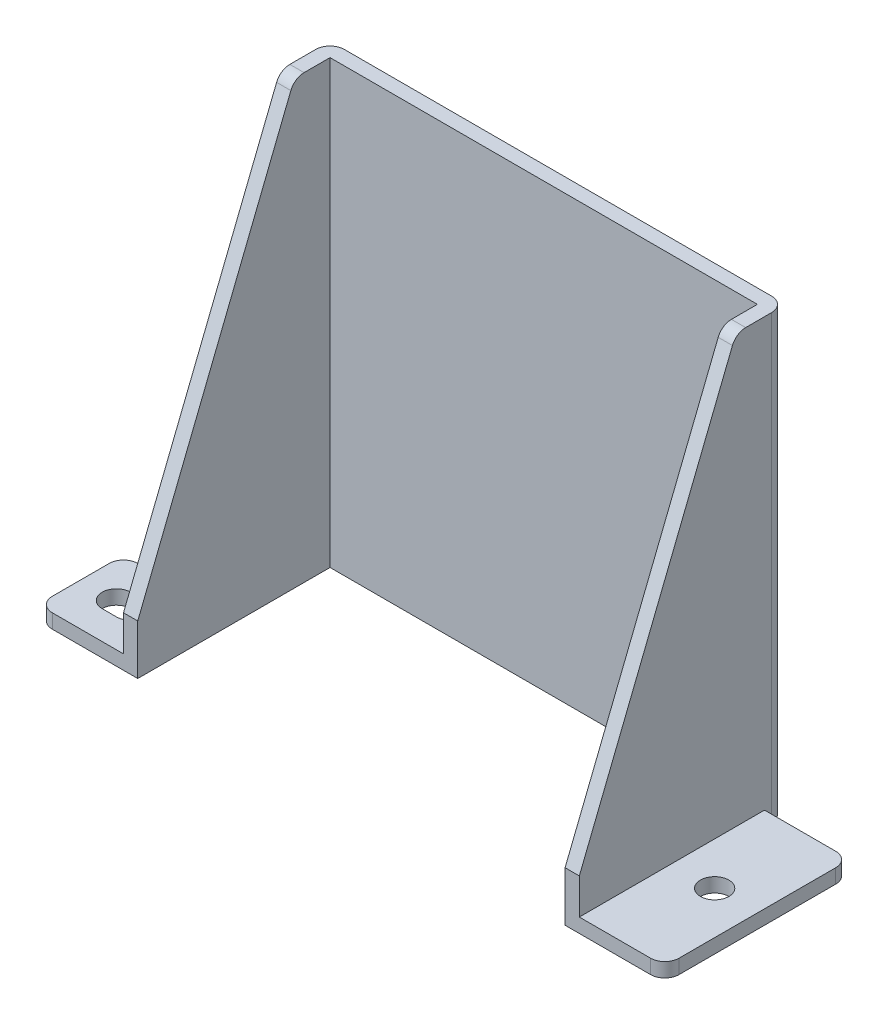
ISO-10303-21;
HEADER;
FILE_DESCRIPTION(('STEP AP214'),'2;1');
FILE_NAME('part.step','',(''),(''),'','','');
FILE_SCHEMA(('AUTOMOTIVE_DESIGN { 1 0 10303 214 1 1 1 1 }'));
ENDSEC;
DATA;
#1=APPLICATION_CONTEXT('core data for automotive mechanical design processes');
#2=APPLICATION_PROTOCOL_DEFINITION('international standard','automotive_design',2000,#1);
#3=PRODUCT_CONTEXT('',#1,'mechanical');
#4=PRODUCT('Part','Part','',(#3));
#5=PRODUCT_RELATED_PRODUCT_CATEGORY('part','',(#4));
#6=PRODUCT_DEFINITION_FORMATION('','',#4);
#7=PRODUCT_DEFINITION_CONTEXT('part definition',#1,'design');
#8=PRODUCT_DEFINITION('design','',#6,#7);
#9=PRODUCT_DEFINITION_SHAPE('','',#8);
#10=(LENGTH_UNIT() NAMED_UNIT(*) SI_UNIT(.MILLI.,.METRE.));
#11=(NAMED_UNIT(*) PLANE_ANGLE_UNIT() SI_UNIT($,.RADIAN.));
#12=(NAMED_UNIT(*) SI_UNIT($,.STERADIAN.) SOLID_ANGLE_UNIT());
#13=UNCERTAINTY_MEASURE_WITH_UNIT(LENGTH_MEASURE(1.E-05),#10,'distance_accuracy_value','');
#14=(GEOMETRIC_REPRESENTATION_CONTEXT(3) GLOBAL_UNCERTAINTY_ASSIGNED_CONTEXT((#13)) GLOBAL_UNIT_ASSIGNED_CONTEXT((#10,
#11,#12)) REPRESENTATION_CONTEXT('',''));
#15=CARTESIAN_POINT('',(0.,0.,0.));
#16=DIRECTION('',(0.,0.,1.));
#17=DIRECTION('',(1.,0.,0.));
#18=AXIS2_PLACEMENT_3D('',#15,#16,#17);
#19=CARTESIAN_POINT('',(0.,2.,0.));
#20=DIRECTION('',(0.,1.,0.));
#21=DIRECTION('',(0.,0.,1.));
#22=AXIS2_PLACEMENT_3D('',#19,#20,#21);
#23=PLANE('',#22);
#24=CARTESIAN_POINT('',(-39.,2.,8.5));
#25=DIRECTION('',(0.,1.,0.));
#26=DIRECTION('',(0.,0.,1.));
#27=AXIS2_PLACEMENT_3D('',#24,#25,#26);
#28=CIRCLE('',#27,2.);
#29=CARTESIAN_POINT('',(-39.,2.,6.5));
#30=VERTEX_POINT('',#29);
#31=CARTESIAN_POINT('',(-39.,2.,10.5));
#32=VERTEX_POINT('',#31);
#33=EDGE_CURVE('E229',#30,#32,#28,.T.);
#34=ORIENTED_EDGE('',*,*,#33,.F.);
#35=DIRECTION('',(-1.,0.,0.));
#36=VECTOR('',#35,1.);
#37=CARTESIAN_POINT('',(-39.,2.,6.5));
#38=LINE('',#37,#36);
#39=CARTESIAN_POINT('',(-37.,2.,6.5));
#40=VERTEX_POINT('',#39);
#41=EDGE_CURVE('E247',#40,#30,#38,.T.);
#42=ORIENTED_EDGE('',*,*,#41,.F.);
#43=CARTESIAN_POINT('',(-37.,2.,8.5));
#44=DIRECTION('',(0.,1.,0.));
#45=DIRECTION('',(0.,0.,1.));
#46=AXIS2_PLACEMENT_3D('',#43,#44,#45);
#47=CIRCLE('',#46,2.);
#48=CARTESIAN_POINT('',(-37.,2.,10.5));
#49=VERTEX_POINT('',#48);
#50=EDGE_CURVE('E250',#49,#40,#47,.T.);
#51=ORIENTED_EDGE('',*,*,#50,.F.);
#52=DIRECTION('',(1.,0.,0.));
#53=VECTOR('',#52,1.);
#54=CARTESIAN_POINT('',(-39.,2.,10.5));
#55=LINE('',#54,#53);
#56=EDGE_CURVE('E256',#32,#49,#55,.T.);
#57=ORIENTED_EDGE('',*,*,#56,.F.);
#58=EDGE_LOOP('',(#34,#42,#51,#57));
#59=FACE_BOUND('',#58,.T.);
#60=DIRECTION('',(1.,0.,0.));
#61=VECTOR('',#60,1.);
#62=CARTESIAN_POINT('',(0.,2.,2.5));
#63=LINE('',#62,#61);
#64=CARTESIAN_POINT('',(-42.,2.,2.5));
#65=VERTEX_POINT('',#64);
#66=CARTESIAN_POINT('',(-32.,2.,2.5));
#67=VERTEX_POINT('',#66);
#68=EDGE_CURVE('E317',#65,#67,#63,.T.);
#69=ORIENTED_EDGE('',*,*,#68,.F.);
#70=CARTESIAN_POINT('',(-42.,2.,4.5));
#71=DIRECTION('',(0.,1.,0.));
#72=DIRECTION('',(0.,0.,1.));
#73=AXIS2_PLACEMENT_3D('',#70,#71,#72);
#74=CIRCLE('',#73,2.);
#75=CARTESIAN_POINT('',(-44.,2.,4.5));
#76=VERTEX_POINT('',#75);
#77=EDGE_CURVE('E43',#65,#76,#74,.T.);
#78=ORIENTED_EDGE('',*,*,#77,.T.);
#79=DIRECTION('',(0.,0.,-1.));
#80=VECTOR('',#79,1.);
#81=CARTESIAN_POINT('',(-44.,2.,0.));
#82=LINE('',#81,#80);
#83=CARTESIAN_POINT('',(-44.,2.,12.5));
#84=VERTEX_POINT('',#83);
#85=EDGE_CURVE('E320',#84,#76,#82,.T.);
#86=ORIENTED_EDGE('',*,*,#85,.F.);
#87=CARTESIAN_POINT('',(-42.,2.,12.5));
#88=DIRECTION('',(0.,1.,0.));
#89=DIRECTION('',(0.,0.,1.));
#90=AXIS2_PLACEMENT_3D('',#87,#88,#89);
#91=CIRCLE('',#90,2.);
#92=CARTESIAN_POINT('',(-42.,2.,14.5));
#93=VERTEX_POINT('',#92);
#94=EDGE_CURVE('E50',#84,#93,#91,.T.);
#95=ORIENTED_EDGE('',*,*,#94,.T.);
#96=DIRECTION('',(1.,0.,0.));
#97=VECTOR('',#96,1.);
#98=CARTESIAN_POINT('',(0.,2.,14.5));
#99=LINE('',#98,#97);
#100=CARTESIAN_POINT('',(-32.,2.,14.5));
#101=VERTEX_POINT('',#100);
#102=EDGE_CURVE('E323',#93,#101,#99,.T.);
#103=ORIENTED_EDGE('',*,*,#102,.T.);
#104=DIRECTION('',(0.,0.,-1.));
#105=VECTOR('',#104,1.);
#106=CARTESIAN_POINT('',(-32.,2.,0.));
#107=LINE('',#106,#105);
#108=EDGE_CURVE('E284',#101,#67,#107,.T.);
#109=ORIENTED_EDGE('',*,*,#108,.T.);
#110=EDGE_LOOP('',(#69,#78,#86,#95,#103,#109));
#111=FACE_BOUND('',#110,.T.);
#112=ADVANCED_FACE('F35',(#59,#111),#23,.T.);
#113=CARTESIAN_POINT('',(38.,2.,1.5));
#114=DIRECTION('',(0.,1.,0.));
#115=DIRECTION('',(0.,0.,1.));
#116=AXIS2_PLACEMENT_3D('',#113,#114,#115);
#117=CIRCLE('',#116,2.);
#118=CARTESIAN_POINT('',(38.,2.,3.5));
#119=VERTEX_POINT('',#118);
#120=EDGE_CURVE('E269',#119,#119,#117,.T.);
#121=ORIENTED_EDGE('',*,*,#120,.F.);
#122=EDGE_LOOP('',(#121));
#123=FACE_BOUND('',#122,.T.);
#124=DIRECTION('',(0.,0.,-1.));
#125=VECTOR('',#124,1.);
#126=CARTESIAN_POINT('',(44.,2.,0.));
#127=LINE('',#126,#125);
#128=CARTESIAN_POINT('',(44.,2.,12.5));
#129=VERTEX_POINT('',#128);
#130=CARTESIAN_POINT('',(44.,2.,-9.5));
#131=VERTEX_POINT('',#130);
#132=EDGE_CURVE('E328',#129,#131,#127,.T.);
#133=ORIENTED_EDGE('',*,*,#132,.T.);
#134=CARTESIAN_POINT('',(42.,2.,-9.5));
#135=DIRECTION('',(0.,1.,0.));
#136=DIRECTION('',(0.,0.,1.));
#137=AXIS2_PLACEMENT_3D('',#134,#135,#136);
#138=CIRCLE('',#137,2.);
#139=CARTESIAN_POINT('',(42.,2.,-11.5));
#140=VERTEX_POINT('',#139);
#141=EDGE_CURVE('E397',#131,#140,#138,.T.);
#142=ORIENTED_EDGE('',*,*,#141,.T.);
#143=DIRECTION('',(-1.,0.,0.));
#144=VECTOR('',#143,1.);
#145=CARTESIAN_POINT('',(0.,2.,-11.5));
#146=LINE('',#145,#144);
#147=CARTESIAN_POINT('',(32.,2.,-11.5));
#148=VERTEX_POINT('',#147);
#149=EDGE_CURVE('E315',#140,#148,#146,.T.);
#150=ORIENTED_EDGE('',*,*,#149,.T.);
#151=DIRECTION('',(0.,0.,1.));
#152=VECTOR('',#151,1.);
#153=CARTESIAN_POINT('',(32.,2.,0.));
#154=LINE('',#153,#152);
#155=CARTESIAN_POINT('',(32.,2.,14.5));
#156=VERTEX_POINT('',#155);
#157=EDGE_CURVE('E305',#148,#156,#154,.T.);
#158=ORIENTED_EDGE('',*,*,#157,.T.);
#159=DIRECTION('',(1.,0.,0.));
#160=VECTOR('',#159,1.);
#161=CARTESIAN_POINT('',(0.,2.,14.5));
#162=LINE('',#161,#160);
#163=CARTESIAN_POINT('',(42.,2.,14.5));
#164=VERTEX_POINT('',#163);
#165=EDGE_CURVE('E325',#156,#164,#162,.T.);
#166=ORIENTED_EDGE('',*,*,#165,.T.);
#167=CARTESIAN_POINT('',(42.,2.,12.5));
#168=DIRECTION('',(0.,1.,0.));
#169=DIRECTION('',(0.,0.,1.));
#170=AXIS2_PLACEMENT_3D('',#167,#168,#169);
#171=CIRCLE('',#170,2.);
#172=EDGE_CURVE('E395',#164,#129,#171,.T.);
#173=ORIENTED_EDGE('',*,*,#172,.T.);
#174=EDGE_LOOP('',(#133,#142,#150,#158,#166,#173));
#175=FACE_BOUND('',#174,.T.);
#176=ADVANCED_FACE('F527',(#123,#175),#23,.T.);
#177=CARTESIAN_POINT('',(0.,2.,-11.5));
#178=DIRECTION('',(0.,0.,1.));
#179=DIRECTION('',(1.,0.,0.));
#180=AXIS2_PLACEMENT_3D('',#177,#178,#179);
#181=PLANE('',#180);
#182=ORIENTED_EDGE('',*,*,#149,.F.);
#183=DIRECTION('',(0.,-1.,0.));
#184=VECTOR('',#183,1.);
#185=CARTESIAN_POINT('',(42.,2.,-11.5));
#186=LINE('',#185,#184);
#187=CARTESIAN_POINT('',(42.,0.,-11.5));
#188=VERTEX_POINT('',#187);
#189=EDGE_CURVE('E308',#140,#188,#186,.T.);
#190=ORIENTED_EDGE('',*,*,#189,.T.);
#191=DIRECTION('',(-1.,0.,0.));
#192=VECTOR('',#191,1.);
#193=CARTESIAN_POINT('',(0.,0.,-11.5));
#194=LINE('',#193,#192);
#195=CARTESIAN_POINT('',(32.,0.,-11.5));
#196=VERTEX_POINT('',#195);
#197=EDGE_CURVE('E314',#188,#196,#194,.T.);
#198=ORIENTED_EDGE('',*,*,#197,.T.);
#199=DIRECTION('',(0.,-1.,0.));
#200=VECTOR('',#199,1.);
#201=CARTESIAN_POINT('',(32.,2.,-11.5));
#202=LINE('',#201,#200);
#203=EDGE_CURVE('E309',#148,#196,#202,.T.);
#204=ORIENTED_EDGE('',*,*,#203,.F.);
#205=EDGE_LOOP('',(#182,#190,#198,#204));
#206=FACE_BOUND('',#205,.T.);
#207=ADVANCED_FACE('F515',(#206),#181,.F.);
#208=CARTESIAN_POINT('',(32.,2.,0.));
#209=DIRECTION('',(-1.,0.,0.));
#210=DIRECTION('',(0.,0.,1.));
#211=AXIS2_PLACEMENT_3D('',#208,#209,#210);
#212=PLANE('',#211);
#213=DIRECTION('',(0.,0.,1.));
#214=VECTOR('',#213,1.);
#215=CARTESIAN_POINT('',(32.,62.,0.));
#216=LINE('',#215,#214);
#217=CARTESIAN_POINT('',(32.,62.,-12.5));
#218=VERTEX_POINT('',#217);
#219=CARTESIAN_POINT('',(32.,62.,-8.8540659228538));
#220=VERTEX_POINT('',#219);
#221=EDGE_CURVE('E296',#218,#220,#216,.T.);
#222=ORIENTED_EDGE('',*,*,#221,.T.);
#223=CARTESIAN_POINT('',(32.,60.,-8.8540659228538));
#224=DIRECTION('',(-1.,0.,0.));
#225=DIRECTION('',(0.,0.,1.));
#226=AXIS2_PLACEMENT_3D('',#223,#224,#225);
#227=CIRCLE('',#226,2.);
#228=CARTESIAN_POINT('',(32.,60.7427813527082,-6.99711254108329));
#229=VERTEX_POINT('',#228);
#230=EDGE_CURVE('E416',#220,#229,#227,.F.);
#231=ORIENTED_EDGE('',*,*,#230,.T.);
#232=DIRECTION('',(0.,-0.928476690885259,0.371390676354104));
#233=VECTOR('',#232,1.);
#234=CARTESIAN_POINT('',(31.9999999999999,7.68965517241377,14.2241379310345));
#235=LINE('',#234,#233);
#236=CARTESIAN_POINT('',(32.,7.,14.5));
#237=VERTEX_POINT('',#236);
#238=EDGE_CURVE('E282',#229,#237,#235,.T.);
#239=ORIENTED_EDGE('',*,*,#238,.T.);
#240=DIRECTION('',(0.,-1.,0.));
#241=VECTOR('',#240,1.);
#242=CARTESIAN_POINT('',(32.,62.,14.5));
#243=LINE('',#242,#241);
#244=EDGE_CURVE('E302',#237,#156,#243,.T.);
#245=ORIENTED_EDGE('',*,*,#244,.T.);
#246=ORIENTED_EDGE('',*,*,#157,.F.);
#247=ORIENTED_EDGE('',*,*,#203,.T.);
#248=DIRECTION('',(0.,0.,-1.));
#249=VECTOR('',#248,1.);
#250=CARTESIAN_POINT('',(32.,0.,0.));
#251=LINE('',#250,#249);
#252=CARTESIAN_POINT('',(32.,0.,-12.5));
#253=VERTEX_POINT('',#252);
#254=EDGE_CURVE('E333',#196,#253,#251,.T.);
#255=ORIENTED_EDGE('',*,*,#254,.T.);
#256=DIRECTION('',(0.,-1.,0.));
#257=VECTOR('',#256,1.);
#258=CARTESIAN_POINT('',(32.,62.,-12.5));
#259=LINE('',#258,#257);
#260=EDGE_CURVE('E414',#253,#218,#259,.F.);
#261=ORIENTED_EDGE('',*,*,#260,.T.);
#262=EDGE_LOOP('',(#222,#231,#239,#245,#246,#247,#255,#261));
#263=FACE_BOUND('',#262,.T.);
#264=ADVANCED_FACE('F504',(#263),#212,.F.);
#265=CARTESIAN_POINT('',(0.,2.,-14.5));
#266=DIRECTION('',(0.,0.,-1.));
#267=DIRECTION('',(-1.,0.,0.));
#268=AXIS2_PLACEMENT_3D('',#265,#266,#267);
#269=PLANE('',#268);
#270=DIRECTION('',(1.,0.,0.));
#271=VECTOR('',#270,1.);
#272=CARTESIAN_POINT('',(0.,0.,-14.5));
#273=LINE('',#272,#271);
#274=CARTESIAN_POINT('',(-30.,0.,-14.5));
#275=VERTEX_POINT('',#274);
#276=CARTESIAN_POINT('',(30.,0.,-14.5));
#277=VERTEX_POINT('',#276);
#278=EDGE_CURVE('E336',#275,#277,#273,.T.);
#279=ORIENTED_EDGE('',*,*,#278,.F.);
#280=DIRECTION('',(0.,-1.,0.));
#281=VECTOR('',#280,1.);
#282=CARTESIAN_POINT('',(-30.,2.,-14.5));
#283=LINE('',#282,#281);
#284=CARTESIAN_POINT('',(-30.,62.,-14.5));
#285=VERTEX_POINT('',#284);
#286=EDGE_CURVE('E431',#275,#285,#283,.F.);
#287=ORIENTED_EDGE('',*,*,#286,.T.);
#288=DIRECTION('',(-1.,0.,0.));
#289=VECTOR('',#288,1.);
#290=CARTESIAN_POINT('',(0.,62.,-14.5));
#291=LINE('',#290,#289);
#292=CARTESIAN_POINT('',(30.,62.,-14.5));
#293=VERTEX_POINT('',#292);
#294=EDGE_CURVE('E299',#293,#285,#291,.T.);
#295=ORIENTED_EDGE('',*,*,#294,.F.);
#296=DIRECTION('',(0.,-1.,0.));
#297=VECTOR('',#296,1.);
#298=CARTESIAN_POINT('',(30.,0.,-14.5));
#299=LINE('',#298,#297);
#300=EDGE_CURVE('E428',#293,#277,#299,.T.);
#301=ORIENTED_EDGE('',*,*,#300,.T.);
#302=EDGE_LOOP('',(#279,#287,#295,#301));
#303=FACE_BOUND('',#302,.T.);
#304=ADVANCED_FACE('F461',(#303),#269,.T.);
#305=CARTESIAN_POINT('',(-32.,2.,0.));
#306=DIRECTION('',(-1.,0.,0.));
#307=DIRECTION('',(0.,0.,1.));
#308=AXIS2_PLACEMENT_3D('',#305,#306,#307);
#309=PLANE('',#308);
#310=DIRECTION('',(0.,-0.928476690885259,0.371390676354104));
#311=VECTOR('',#310,1.);
#312=CARTESIAN_POINT('',(-32.,7.68965517241379,14.2241379310345));
#313=LINE('',#312,#311);
#314=CARTESIAN_POINT('',(-32.,60.7427813527082,-6.99711254108329));
#315=VERTEX_POINT('',#314);
#316=CARTESIAN_POINT('',(-32.,7.,14.5));
#317=VERTEX_POINT('',#316);
#318=EDGE_CURVE('E280',#315,#317,#313,.T.);
#319=ORIENTED_EDGE('',*,*,#318,.F.);
#320=CARTESIAN_POINT('',(-32.,60.,-8.8540659228538));
#321=DIRECTION('',(-1.,0.,0.));
#322=DIRECTION('',(0.,0.,1.));
#323=AXIS2_PLACEMENT_3D('',#320,#321,#322);
#324=CIRCLE('',#323,2.);
#325=CARTESIAN_POINT('',(-32.,62.,-8.8540659228538));
#326=VERTEX_POINT('',#325);
#327=EDGE_CURVE('E424',#315,#326,#324,.T.);
#328=ORIENTED_EDGE('',*,*,#327,.T.);
#329=DIRECTION('',(0.,0.,-1.));
#330=VECTOR('',#329,1.);
#331=CARTESIAN_POINT('',(-32.,62.,0.));
#332=LINE('',#331,#330);
#333=CARTESIAN_POINT('',(-32.,62.,-12.5));
#334=VERTEX_POINT('',#333);
#335=EDGE_CURVE('E285',#326,#334,#332,.T.);
#336=ORIENTED_EDGE('',*,*,#335,.T.);
#337=DIRECTION('',(0.,-1.,0.));
#338=VECTOR('',#337,1.);
#339=CARTESIAN_POINT('',(-32.,2.,-12.5));
#340=LINE('',#339,#338);
#341=CARTESIAN_POINT('',(-32.,0.,-12.5));
#342=VERTEX_POINT('',#341);
#343=EDGE_CURVE('E421',#334,#342,#340,.T.);
#344=ORIENTED_EDGE('',*,*,#343,.T.);
#345=DIRECTION('',(0.,0.,-1.));
#346=VECTOR('',#345,1.);
#347=CARTESIAN_POINT('',(-32.,0.,0.));
#348=LINE('',#347,#346);
#349=CARTESIAN_POINT('',(-32.,0.,2.5));
#350=VERTEX_POINT('',#349);
#351=EDGE_CURVE('E339',#350,#342,#348,.T.);
#352=ORIENTED_EDGE('',*,*,#351,.F.);
#353=DIRECTION('',(0.,-1.,0.));
#354=VECTOR('',#353,1.);
#355=CARTESIAN_POINT('',(-32.,2.,2.5));
#356=LINE('',#355,#354);
#357=EDGE_CURVE('E371',#67,#350,#356,.T.);
#358=ORIENTED_EDGE('',*,*,#357,.F.);
#359=ORIENTED_EDGE('',*,*,#108,.F.);
#360=DIRECTION('',(0.,-1.,0.));
#361=VECTOR('',#360,1.);
#362=CARTESIAN_POINT('',(-32.,62.,14.5));
#363=LINE('',#362,#361);
#364=EDGE_CURVE('E311',#317,#101,#363,.T.);
#365=ORIENTED_EDGE('',*,*,#364,.F.);
#366=EDGE_LOOP('',(#319,#328,#336,#344,#352,#358,#359,#365));
#367=FACE_BOUND('',#366,.T.);
#368=ADVANCED_FACE('F455',(#367),#309,.T.);
#369=CARTESIAN_POINT('',(0.,2.,2.5));
#370=DIRECTION('',(0.,0.,-1.));
#371=DIRECTION('',(-1.,0.,0.));
#372=AXIS2_PLACEMENT_3D('',#369,#370,#371);
#373=PLANE('',#372);
#374=DIRECTION('',(1.,0.,0.));
#375=VECTOR('',#374,1.);
#376=CARTESIAN_POINT('',(0.,0.,2.5));
#377=LINE('',#376,#375);
#378=CARTESIAN_POINT('',(-42.,0.,2.5));
#379=VERTEX_POINT('',#378);
#380=EDGE_CURVE('E342',#379,#350,#377,.T.);
#381=ORIENTED_EDGE('',*,*,#380,.F.);
#382=DIRECTION('',(0.,-1.,0.));
#383=VECTOR('',#382,1.);
#384=CARTESIAN_POINT('',(-42.,2.,2.5));
#385=LINE('',#384,#383);
#386=EDGE_CURVE('E58',#379,#65,#385,.F.);
#387=ORIENTED_EDGE('',*,*,#386,.T.);
#388=ORIENTED_EDGE('',*,*,#68,.T.);
#389=ORIENTED_EDGE('',*,*,#357,.T.);
#390=EDGE_LOOP('',(#381,#387,#388,#389));
#391=FACE_BOUND('',#390,.T.);
#392=ADVANCED_FACE('F449',(#391),#373,.T.);
#393=CARTESIAN_POINT('',(-44.,2.,0.));
#394=DIRECTION('',(-1.,0.,0.));
#395=DIRECTION('',(0.,0.,1.));
#396=AXIS2_PLACEMENT_3D('',#393,#394,#395);
#397=PLANE('',#396);
#398=ORIENTED_EDGE('',*,*,#85,.T.);
#399=DIRECTION('',(0.,-1.,0.));
#400=VECTOR('',#399,1.);
#401=CARTESIAN_POINT('',(-44.,2.,4.5));
#402=LINE('',#401,#400);
#403=CARTESIAN_POINT('',(-44.,0.,4.5));
#404=VERTEX_POINT('',#403);
#405=EDGE_CURVE('E435',#76,#404,#402,.T.);
#406=ORIENTED_EDGE('',*,*,#405,.T.);
#407=DIRECTION('',(0.,0.,-1.));
#408=VECTOR('',#407,1.);
#409=CARTESIAN_POINT('',(-44.,0.,0.));
#410=LINE('',#409,#408);
#411=CARTESIAN_POINT('',(-44.,0.,12.5));
#412=VERTEX_POINT('',#411);
#413=EDGE_CURVE('E344',#412,#404,#410,.T.);
#414=ORIENTED_EDGE('',*,*,#413,.F.);
#415=DIRECTION('',(0.,-1.,0.));
#416=VECTOR('',#415,1.);
#417=CARTESIAN_POINT('',(-44.,2.,12.5));
#418=LINE('',#417,#416);
#419=EDGE_CURVE('E433',#412,#84,#418,.F.);
#420=ORIENTED_EDGE('',*,*,#419,.T.);
#421=EDGE_LOOP('',(#398,#406,#414,#420));
#422=FACE_BOUND('',#421,.T.);
#423=ADVANCED_FACE('F443',(#422),#397,.T.);
#424=CARTESIAN_POINT('',(0.,2.,14.5));
#425=DIRECTION('',(0.,0.,-1.));
#426=DIRECTION('',(-1.,0.,0.));
#427=AXIS2_PLACEMENT_3D('',#424,#425,#426);
#428=PLANE('',#427);
#429=ORIENTED_EDGE('',*,*,#102,.F.);
#430=DIRECTION('',(0.,-1.,0.));
#431=VECTOR('',#430,1.);
#432=CARTESIAN_POINT('',(-42.,0.,14.5));
#433=LINE('',#432,#431);
#434=CARTESIAN_POINT('',(-42.,0.,14.5));
#435=VERTEX_POINT('',#434);
#436=EDGE_CURVE('E11',#93,#435,#433,.T.);
#437=ORIENTED_EDGE('',*,*,#436,.T.);
#438=DIRECTION('',(1.,0.,0.));
#439=VECTOR('',#438,1.);
#440=CARTESIAN_POINT('',(0.,0.,14.5));
#441=LINE('',#440,#439);
#442=CARTESIAN_POINT('',(-30.,0.,14.5));
#443=VERTEX_POINT('',#442);
#444=EDGE_CURVE('E347',#435,#443,#441,.T.);
#445=ORIENTED_EDGE('',*,*,#444,.T.);
#446=DIRECTION('',(0.,-1.,0.));
#447=VECTOR('',#446,1.);
#448=CARTESIAN_POINT('',(-30.,2.,14.5));
#449=LINE('',#448,#447);
#450=CARTESIAN_POINT('',(-30.,7.,14.5));
#451=VERTEX_POINT('',#450);
#452=EDGE_CURVE('E368',#451,#443,#449,.T.);
#453=ORIENTED_EDGE('',*,*,#452,.F.);
#454=DIRECTION('',(1.,0.,0.));
#455=VECTOR('',#454,1.);
#456=CARTESIAN_POINT('',(-44.,7.,14.5));
#457=LINE('',#456,#455);
#458=EDGE_CURVE('E274',#317,#451,#457,.T.);
#459=ORIENTED_EDGE('',*,*,#458,.F.);
#460=ORIENTED_EDGE('',*,*,#364,.T.);
#461=EDGE_LOOP('',(#429,#437,#445,#453,#459,#460));
#462=FACE_BOUND('',#461,.T.);
#463=ADVANCED_FACE('F546',(#462),#428,.F.);
#464=CARTESIAN_POINT('',(-30.,2.,0.));
#465=DIRECTION('',(-1.,0.,0.));
#466=DIRECTION('',(0.,0.,1.));
#467=AXIS2_PLACEMENT_3D('',#464,#465,#466);
#468=PLANE('',#467);
#469=DIRECTION('',(0.,0.,-1.));
#470=VECTOR('',#469,1.);
#471=CARTESIAN_POINT('',(-30.,62.,0.));
#472=LINE('',#471,#470);
#473=CARTESIAN_POINT('',(-30.,62.,-8.8540659228538));
#474=VERTEX_POINT('',#473);
#475=CARTESIAN_POINT('',(-30.,62.,-12.5));
#476=VERTEX_POINT('',#475);
#477=EDGE_CURVE('E288',#474,#476,#472,.T.);
#478=ORIENTED_EDGE('',*,*,#477,.F.);
#479=CARTESIAN_POINT('',(-30.,60.,-8.8540659228538));
#480=DIRECTION('',(-1.,0.,0.));
#481=DIRECTION('',(0.,0.,1.));
#482=AXIS2_PLACEMENT_3D('',#479,#480,#481);
#483=CIRCLE('',#482,2.);
#484=CARTESIAN_POINT('',(-30.,60.7427813527082,-6.99711254108329));
#485=VERTEX_POINT('',#484);
#486=EDGE_CURVE('E426',#474,#485,#483,.F.);
#487=ORIENTED_EDGE('',*,*,#486,.T.);
#488=DIRECTION('',(0.,-0.928476690885259,0.371390676354104));
#489=VECTOR('',#488,1.);
#490=CARTESIAN_POINT('',(-30.,7.68965517241379,14.2241379310345));
#491=LINE('',#490,#489);
#492=EDGE_CURVE('E278',#485,#451,#491,.T.);
#493=ORIENTED_EDGE('',*,*,#492,.T.);
#494=ORIENTED_EDGE('',*,*,#452,.T.);
#495=DIRECTION('',(0.,0.,-1.));
#496=VECTOR('',#495,1.);
#497=CARTESIAN_POINT('',(-30.,0.,0.));
#498=LINE('',#497,#496);
#499=CARTESIAN_POINT('',(-30.,0.,-12.5));
#500=VERTEX_POINT('',#499);
#501=EDGE_CURVE('E349',#443,#500,#498,.T.);
#502=ORIENTED_EDGE('',*,*,#501,.T.);
#503=DIRECTION('',(0.,-1.,0.));
#504=VECTOR('',#503,1.);
#505=CARTESIAN_POINT('',(-30.,2.,-12.5));
#506=LINE('',#505,#504);
#507=EDGE_CURVE('E365',#476,#500,#506,.T.);
#508=ORIENTED_EDGE('',*,*,#507,.F.);
#509=EDGE_LOOP('',(#478,#487,#493,#494,#502,#508));
#510=FACE_BOUND('',#509,.T.);
#511=ADVANCED_FACE('F483',(#510),#468,.F.);
#512=CARTESIAN_POINT('',(0.,2.,-12.5));
#513=DIRECTION('',(0.,0.,-1.));
#514=DIRECTION('',(-1.,0.,0.));
#515=AXIS2_PLACEMENT_3D('',#512,#513,#514);
#516=PLANE('',#515);
#517=DIRECTION('',(1.,0.,0.));
#518=VECTOR('',#517,1.);
#519=CARTESIAN_POINT('',(0.,0.,-12.5));
#520=LINE('',#519,#518);
#521=CARTESIAN_POINT('',(30.,0.,-12.5));
#522=VERTEX_POINT('',#521);
#523=EDGE_CURVE('E351',#500,#522,#520,.T.);
#524=ORIENTED_EDGE('',*,*,#523,.T.);
#525=DIRECTION('',(0.,-1.,0.));
#526=VECTOR('',#525,1.);
#527=CARTESIAN_POINT('',(30.,2.,-12.5));
#528=LINE('',#527,#526);
#529=CARTESIAN_POINT('',(30.,62.,-12.5));
#530=VERTEX_POINT('',#529);
#531=EDGE_CURVE('E362',#530,#522,#528,.T.);
#532=ORIENTED_EDGE('',*,*,#531,.F.);
#533=DIRECTION('',(1.,0.,0.));
#534=VECTOR('',#533,1.);
#535=CARTESIAN_POINT('',(0.,62.,-12.5));
#536=LINE('',#535,#534);
#537=EDGE_CURVE('E290',#476,#530,#536,.T.);
#538=ORIENTED_EDGE('',*,*,#537,.F.);
#539=ORIENTED_EDGE('',*,*,#507,.T.);
#540=EDGE_LOOP('',(#524,#532,#538,#539));
#541=FACE_BOUND('',#540,.T.);
#542=ADVANCED_FACE('F538',(#541),#516,.F.);
#543=CARTESIAN_POINT('',(30.,2.,0.));
#544=DIRECTION('',(1.,0.,0.));
#545=DIRECTION('',(0.,0.,-1.));
#546=AXIS2_PLACEMENT_3D('',#543,#544,#545);
#547=PLANE('',#546);
#548=DIRECTION('',(0.,0.928476690885259,-0.371390676354104));
#549=VECTOR('',#548,1.);
#550=CARTESIAN_POINT('',(30.,7.68965517241379,14.2241379310345));
#551=LINE('',#550,#549);
#552=CARTESIAN_POINT('',(30.,7.,14.5));
#553=VERTEX_POINT('',#552);
#554=CARTESIAN_POINT('',(30.,60.7427813527082,-6.99711254108329));
#555=VERTEX_POINT('',#554);
#556=EDGE_CURVE('E275',#553,#555,#551,.T.);
#557=ORIENTED_EDGE('',*,*,#556,.T.);
#558=CARTESIAN_POINT('',(30.,60.,-8.8540659228538));
#559=DIRECTION('',(1.,0.,0.));
#560=DIRECTION('',(0.,0.,-1.));
#561=AXIS2_PLACEMENT_3D('',#558,#559,#560);
#562=CIRCLE('',#561,2.);
#563=CARTESIAN_POINT('',(30.,62.,-8.8540659228538));
#564=VERTEX_POINT('',#563);
#565=EDGE_CURVE('E404',#555,#564,#562,.F.);
#566=ORIENTED_EDGE('',*,*,#565,.T.);
#567=DIRECTION('',(0.,0.,1.));
#568=VECTOR('',#567,1.);
#569=CARTESIAN_POINT('',(30.,62.,0.));
#570=LINE('',#569,#568);
#571=EDGE_CURVE('E293',#530,#564,#570,.T.);
#572=ORIENTED_EDGE('',*,*,#571,.F.);
#573=ORIENTED_EDGE('',*,*,#531,.T.);
#574=DIRECTION('',(0.,0.,1.));
#575=VECTOR('',#574,1.);
#576=CARTESIAN_POINT('',(30.,0.,0.));
#577=LINE('',#576,#575);
#578=CARTESIAN_POINT('',(30.,0.,14.5));
#579=VERTEX_POINT('',#578);
#580=EDGE_CURVE('E353',#522,#579,#577,.T.);
#581=ORIENTED_EDGE('',*,*,#580,.T.);
#582=DIRECTION('',(0.,-1.,0.));
#583=VECTOR('',#582,1.);
#584=CARTESIAN_POINT('',(30.,2.,14.5));
#585=LINE('',#584,#583);
#586=EDGE_CURVE('E331',#553,#579,#585,.T.);
#587=ORIENTED_EDGE('',*,*,#586,.F.);
#588=EDGE_LOOP('',(#557,#566,#572,#573,#581,#587));
#589=FACE_BOUND('',#588,.T.);
#590=ADVANCED_FACE('F491',(#589),#547,.F.);
#591=CARTESIAN_POINT('',(0.,2.,14.5));
#592=DIRECTION('',(0.,0.,-1.));
#593=DIRECTION('',(-1.,0.,0.));
#594=AXIS2_PLACEMENT_3D('',#591,#592,#593);
#595=PLANE('',#594);
#596=DIRECTION('',(1.,0.,0.));
#597=VECTOR('',#596,1.);
#598=CARTESIAN_POINT('',(0.,0.,14.5));
#599=LINE('',#598,#597);
#600=CARTESIAN_POINT('',(42.,0.,14.5));
#601=VERTEX_POINT('',#600);
#602=EDGE_CURVE('E356',#579,#601,#599,.T.);
#603=ORIENTED_EDGE('',*,*,#602,.T.);
#604=DIRECTION('',(0.,-1.,0.));
#605=VECTOR('',#604,1.);
#606=CARTESIAN_POINT('',(42.,2.,14.5));
#607=LINE('',#606,#605);
#608=EDGE_CURVE('E399',#601,#164,#607,.F.);
#609=ORIENTED_EDGE('',*,*,#608,.T.);
#610=ORIENTED_EDGE('',*,*,#165,.F.);
#611=ORIENTED_EDGE('',*,*,#244,.F.);
#612=EDGE_CURVE('E263',#553,#237,#457,.T.);
#613=ORIENTED_EDGE('',*,*,#612,.F.);
#614=ORIENTED_EDGE('',*,*,#586,.T.);
#615=EDGE_LOOP('',(#603,#609,#610,#611,#613,#614));
#616=FACE_BOUND('',#615,.T.);
#617=ADVANCED_FACE('F534',(#616),#595,.F.);
#618=CARTESIAN_POINT('',(44.,2.,0.));
#619=DIRECTION('',(-1.,0.,0.));
#620=DIRECTION('',(0.,0.,1.));
#621=AXIS2_PLACEMENT_3D('',#618,#619,#620);
#622=PLANE('',#621);
#623=DIRECTION('',(0.,0.,-1.));
#624=VECTOR('',#623,1.);
#625=CARTESIAN_POINT('',(44.,0.,0.));
#626=LINE('',#625,#624);
#627=CARTESIAN_POINT('',(44.,0.,12.5));
#628=VERTEX_POINT('',#627);
#629=CARTESIAN_POINT('',(44.,0.,-9.5));
#630=VERTEX_POINT('',#629);
#631=EDGE_CURVE('E318',#628,#630,#626,.T.);
#632=ORIENTED_EDGE('',*,*,#631,.T.);
#633=DIRECTION('',(0.,-1.,0.));
#634=VECTOR('',#633,1.);
#635=CARTESIAN_POINT('',(44.,2.,-9.5));
#636=LINE('',#635,#634);
#637=EDGE_CURVE('E393',#630,#131,#636,.F.);
#638=ORIENTED_EDGE('',*,*,#637,.T.);
#639=ORIENTED_EDGE('',*,*,#132,.F.);
#640=DIRECTION('',(0.,-1.,0.));
#641=VECTOR('',#640,1.);
#642=CARTESIAN_POINT('',(44.,2.,12.5));
#643=LINE('',#642,#641);
#644=EDGE_CURVE('E390',#129,#628,#643,.T.);
#645=ORIENTED_EDGE('',*,*,#644,.T.);
#646=EDGE_LOOP('',(#632,#638,#639,#645));
#647=FACE_BOUND('',#646,.T.);
#648=ADVANCED_FACE('F521',(#647),#622,.F.);
#649=CARTESIAN_POINT('',(0.,0.,0.));
#650=DIRECTION('',(0.,1.,0.));
#651=DIRECTION('',(0.,0.,1.));
#652=AXIS2_PLACEMENT_3D('',#649,#650,#651);
#653=PLANE('',#652);
#654=DIRECTION('',(-1.,0.,0.));
#655=VECTOR('',#654,1.);
#656=CARTESIAN_POINT('',(-39.,0.,6.5));
#657=LINE('',#656,#655);
#658=CARTESIAN_POINT('',(-37.,0.,6.5));
#659=VERTEX_POINT('',#658);
#660=CARTESIAN_POINT('',(-39.,0.,6.5));
#661=VERTEX_POINT('',#660);
#662=EDGE_CURVE('E234',#659,#661,#657,.T.);
#663=ORIENTED_EDGE('',*,*,#662,.T.);
#664=CARTESIAN_POINT('',(-39.,0.,8.5));
#665=DIRECTION('',(0.,1.,0.));
#666=DIRECTION('',(0.,0.,1.));
#667=AXIS2_PLACEMENT_3D('',#664,#665,#666);
#668=CIRCLE('',#667,2.);
#669=CARTESIAN_POINT('',(-39.,0.,10.5));
#670=VERTEX_POINT('',#669);
#671=EDGE_CURVE('E226',#661,#670,#668,.T.);
#672=ORIENTED_EDGE('',*,*,#671,.T.);
#673=DIRECTION('',(1.,0.,0.));
#674=VECTOR('',#673,1.);
#675=CARTESIAN_POINT('',(-39.,0.,10.5));
#676=LINE('',#675,#674);
#677=CARTESIAN_POINT('',(-37.,0.,10.5));
#678=VERTEX_POINT('',#677);
#679=EDGE_CURVE('E238',#670,#678,#676,.T.);
#680=ORIENTED_EDGE('',*,*,#679,.T.);
#681=CARTESIAN_POINT('',(-37.,0.,8.5));
#682=DIRECTION('',(0.,1.,0.));
#683=DIRECTION('',(0.,0.,1.));
#684=AXIS2_PLACEMENT_3D('',#681,#682,#683);
#685=CIRCLE('',#684,2.);
#686=EDGE_CURVE('E242',#678,#659,#685,.T.);
#687=ORIENTED_EDGE('',*,*,#686,.T.);
#688=EDGE_LOOP('',(#663,#672,#680,#687));
#689=FACE_BOUND('',#688,.T.);
#690=CARTESIAN_POINT('',(38.,0.,1.5));
#691=DIRECTION('',(0.,1.,0.));
#692=DIRECTION('',(0.,0.,1.));
#693=AXIS2_PLACEMENT_3D('',#690,#691,#692);
#694=CIRCLE('',#693,2.);
#695=CARTESIAN_POINT('',(38.,0.,3.5));
#696=VERTEX_POINT('',#695);
#697=EDGE_CURVE('E257',#696,#696,#694,.T.);
#698=ORIENTED_EDGE('',*,*,#697,.T.);
#699=EDGE_LOOP('',(#698));
#700=FACE_BOUND('',#699,.T.);
#701=ORIENTED_EDGE('',*,*,#197,.F.);
#702=CARTESIAN_POINT('',(42.,0.,-9.5));
#703=DIRECTION('',(0.,1.,0.));
#704=DIRECTION('',(0.,0.,1.));
#705=AXIS2_PLACEMENT_3D('',#702,#703,#704);
#706=CIRCLE('',#705,2.);
#707=EDGE_CURVE('E388',#188,#630,#706,.F.);
#708=ORIENTED_EDGE('',*,*,#707,.T.);
#709=ORIENTED_EDGE('',*,*,#631,.F.);
#710=CARTESIAN_POINT('',(42.,0.,12.5));
#711=DIRECTION('',(0.,1.,0.));
#712=DIRECTION('',(0.,0.,1.));
#713=AXIS2_PLACEMENT_3D('',#710,#711,#712);
#714=CIRCLE('',#713,2.);
#715=EDGE_CURVE('E386',#628,#601,#714,.F.);
#716=ORIENTED_EDGE('',*,*,#715,.T.);
#717=ORIENTED_EDGE('',*,*,#602,.F.);
#718=ORIENTED_EDGE('',*,*,#580,.F.);
#719=ORIENTED_EDGE('',*,*,#523,.F.);
#720=ORIENTED_EDGE('',*,*,#501,.F.);
#721=ORIENTED_EDGE('',*,*,#444,.F.);
#722=CARTESIAN_POINT('',(-42.,0.,12.5));
#723=DIRECTION('',(0.,1.,0.));
#724=DIRECTION('',(0.,0.,1.));
#725=AXIS2_PLACEMENT_3D('',#722,#723,#724);
#726=CIRCLE('',#725,2.);
#727=EDGE_CURVE('E378',#435,#412,#726,.F.);
#728=ORIENTED_EDGE('',*,*,#727,.T.);
#729=ORIENTED_EDGE('',*,*,#413,.T.);
#730=CARTESIAN_POINT('',(-42.,0.,4.5));
#731=DIRECTION('',(0.,1.,0.));
#732=DIRECTION('',(0.,0.,1.));
#733=AXIS2_PLACEMENT_3D('',#730,#731,#732);
#734=CIRCLE('',#733,2.);
#735=EDGE_CURVE('E380',#404,#379,#734,.F.);
#736=ORIENTED_EDGE('',*,*,#735,.T.);
#737=ORIENTED_EDGE('',*,*,#380,.T.);
#738=ORIENTED_EDGE('',*,*,#351,.T.);
#739=CARTESIAN_POINT('',(-30.,0.,-12.5));
#740=DIRECTION('',(0.,1.,0.));
#741=DIRECTION('',(0.,0.,1.));
#742=AXIS2_PLACEMENT_3D('',#739,#740,#741);
#743=CIRCLE('',#742,2.);
#744=EDGE_CURVE('E384',#342,#275,#743,.F.);
#745=ORIENTED_EDGE('',*,*,#744,.T.);
#746=ORIENTED_EDGE('',*,*,#278,.T.);
#747=CARTESIAN_POINT('',(30.,0.,-12.5));
#748=DIRECTION('',(0.,1.,0.));
#749=DIRECTION('',(0.,0.,1.));
#750=AXIS2_PLACEMENT_3D('',#747,#748,#749);
#751=CIRCLE('',#750,2.);
#752=EDGE_CURVE('E382',#277,#253,#751,.F.);
#753=ORIENTED_EDGE('',*,*,#752,.T.);
#754=ORIENTED_EDGE('',*,*,#254,.F.);
#755=EDGE_LOOP('',(#701,#708,#709,#716,#717,#718,#719,#720,#721,#728,#729,#736,#737,#738,#745,
#746,#753,#754));
#756=FACE_BOUND('',#755,.T.);
#757=ADVANCED_FACE('F244',(#689,#700,#756),#653,.F.);
#758=CARTESIAN_POINT('',(0.,62.,0.));
#759=DIRECTION('',(0.,1.,0.));
#760=DIRECTION('',(0.,0.,1.));
#761=AXIS2_PLACEMENT_3D('',#758,#759,#760);
#762=PLANE('',#761);
#763=ORIENTED_EDGE('',*,*,#571,.T.);
#764=DIRECTION('',(-1.,0.,0.));
#765=VECTOR('',#764,1.);
#766=CARTESIAN_POINT('',(32.,62.,-8.8540659228538));
#767=LINE('',#766,#765);
#768=EDGE_CURVE('E412',#564,#220,#767,.F.);
#769=ORIENTED_EDGE('',*,*,#768,.T.);
#770=ORIENTED_EDGE('',*,*,#221,.F.);
#771=CARTESIAN_POINT('',(30.,62.,-12.5));
#772=DIRECTION('',(0.,1.,0.));
#773=DIRECTION('',(0.,0.,1.));
#774=AXIS2_PLACEMENT_3D('',#771,#772,#773);
#775=CIRCLE('',#774,2.);
#776=EDGE_CURVE('E406',#218,#293,#775,.T.);
#777=ORIENTED_EDGE('',*,*,#776,.T.);
#778=ORIENTED_EDGE('',*,*,#294,.T.);
#779=CARTESIAN_POINT('',(-30.,62.,-12.5));
#780=DIRECTION('',(0.,1.,0.));
#781=DIRECTION('',(0.,0.,1.));
#782=AXIS2_PLACEMENT_3D('',#779,#780,#781);
#783=CIRCLE('',#782,2.);
#784=EDGE_CURVE('E408',#285,#334,#783,.T.);
#785=ORIENTED_EDGE('',*,*,#784,.T.);
#786=ORIENTED_EDGE('',*,*,#335,.F.);
#787=DIRECTION('',(-1.,0.,0.));
#788=VECTOR('',#787,1.);
#789=CARTESIAN_POINT('',(-30.,62.,-8.8540659228538));
#790=LINE('',#789,#788);
#791=EDGE_CURVE('E410',#326,#474,#790,.F.);
#792=ORIENTED_EDGE('',*,*,#791,.T.);
#793=ORIENTED_EDGE('',*,*,#477,.T.);
#794=ORIENTED_EDGE('',*,*,#537,.T.);
#795=EDGE_LOOP('',(#763,#769,#770,#777,#778,#785,#786,#792,#793,#794));
#796=FACE_BOUND('',#795,.T.);
#797=ADVANCED_FACE('F468',(#796),#762,.T.);
#798=CARTESIAN_POINT('',(-44.,7.,14.5));
#799=DIRECTION('',(0.,-0.371390676354104,-0.928476690885259));
#800=DIRECTION('',(0.,0.928476690885259,-0.371390676354104));
#801=AXIS2_PLACEMENT_3D('',#798,#799,#800);
#802=PLANE('',#801);
#803=ORIENTED_EDGE('',*,*,#492,.F.);
#804=DIRECTION('',(-1.,0.,0.));
#805=VECTOR('',#804,1.);
#806=CARTESIAN_POINT('',(-32.,60.7427813527082,-6.99711254108328));
#807=LINE('',#806,#805);
#808=EDGE_CURVE('E418',#485,#315,#807,.T.);
#809=ORIENTED_EDGE('',*,*,#808,.T.);
#810=ORIENTED_EDGE('',*,*,#318,.T.);
#811=ORIENTED_EDGE('',*,*,#458,.T.);
#812=EDGE_LOOP('',(#803,#809,#810,#811));
#813=FACE_BOUND('',#812,.T.);
#814=ADVANCED_FACE('F477',(#813),#802,.F.);
#815=ORIENTED_EDGE('',*,*,#238,.F.);
#816=DIRECTION('',(-1.,0.,0.));
#817=VECTOR('',#816,1.);
#818=CARTESIAN_POINT('',(30.,60.7427813527082,-6.99711254108328));
#819=LINE('',#818,#817);
#820=EDGE_CURVE('E401',#229,#555,#819,.T.);
#821=ORIENTED_EDGE('',*,*,#820,.T.);
#822=ORIENTED_EDGE('',*,*,#556,.F.);
#823=ORIENTED_EDGE('',*,*,#612,.T.);
#824=EDGE_LOOP('',(#815,#821,#822,#823));
#825=FACE_BOUND('',#824,.T.);
#826=ADVANCED_FACE('F500',(#825),#802,.F.);
#827=CARTESIAN_POINT('',(38.,0.,1.5));
#828=DIRECTION('',(0.,1.,0.));
#829=DIRECTION('',(0.,0.,1.));
#830=AXIS2_PLACEMENT_3D('',#827,#828,#829);
#831=CYLINDRICAL_SURFACE('',#830,2.);
#832=ORIENTED_EDGE('',*,*,#697,.F.);
#833=EDGE_LOOP('',(#832));
#834=FACE_BOUND('',#833,.T.);
#835=ORIENTED_EDGE('',*,*,#120,.T.);
#836=EDGE_LOOP('',(#835));
#837=FACE_BOUND('',#836,.T.);
#838=ADVANCED_FACE('F591',(#834,#837),#831,.F.);
#839=CARTESIAN_POINT('',(-39.,0.,8.5));
#840=DIRECTION('',(0.,1.,0.));
#841=DIRECTION('',(0.,0.,1.));
#842=AXIS2_PLACEMENT_3D('',#839,#840,#841);
#843=CYLINDRICAL_SURFACE('',#842,2.);
#844=ORIENTED_EDGE('',*,*,#33,.T.);
#845=DIRECTION('',(0.,1.,0.));
#846=VECTOR('',#845,1.);
#847=CARTESIAN_POINT('',(-39.,0.,10.5));
#848=LINE('',#847,#846);
#849=EDGE_CURVE('E222',#670,#32,#848,.T.);
#850=ORIENTED_EDGE('',*,*,#849,.F.);
#851=ORIENTED_EDGE('',*,*,#671,.F.);
#852=DIRECTION('',(0.,1.,0.));
#853=VECTOR('',#852,1.);
#854=CARTESIAN_POINT('',(-39.,0.,6.5));
#855=LINE('',#854,#853);
#856=EDGE_CURVE('E261',#661,#30,#855,.T.);
#857=ORIENTED_EDGE('',*,*,#856,.T.);
#858=EDGE_LOOP('',(#844,#850,#851,#857));
#859=FACE_BOUND('',#858,.T.);
#860=ADVANCED_FACE('F224',(#859),#843,.F.);
#861=CARTESIAN_POINT('',(-39.,0.,6.5));
#862=DIRECTION('',(0.,0.,-1.));
#863=DIRECTION('',(-1.,0.,0.));
#864=AXIS2_PLACEMENT_3D('',#861,#862,#863);
#865=PLANE('',#864);
#866=ORIENTED_EDGE('',*,*,#41,.T.);
#867=ORIENTED_EDGE('',*,*,#856,.F.);
#868=ORIENTED_EDGE('',*,*,#662,.F.);
#869=DIRECTION('',(0.,1.,0.));
#870=VECTOR('',#869,1.);
#871=CARTESIAN_POINT('',(-37.,0.,6.5));
#872=LINE('',#871,#870);
#873=EDGE_CURVE('E264',#659,#40,#872,.T.);
#874=ORIENTED_EDGE('',*,*,#873,.T.);
#875=EDGE_LOOP('',(#866,#867,#868,#874));
#876=FACE_BOUND('',#875,.T.);
#877=ADVANCED_FACE('F605',(#876),#865,.F.);
#878=CARTESIAN_POINT('',(-37.,0.,8.5));
#879=DIRECTION('',(0.,1.,0.));
#880=DIRECTION('',(0.,0.,1.));
#881=AXIS2_PLACEMENT_3D('',#878,#879,#880);
#882=CYLINDRICAL_SURFACE('',#881,2.);
#883=ORIENTED_EDGE('',*,*,#50,.T.);
#884=ORIENTED_EDGE('',*,*,#873,.F.);
#885=ORIENTED_EDGE('',*,*,#686,.F.);
#886=DIRECTION('',(0.,1.,0.));
#887=VECTOR('',#886,1.);
#888=CARTESIAN_POINT('',(-37.,0.,10.5));
#889=LINE('',#888,#887);
#890=EDGE_CURVE('E233',#678,#49,#889,.T.);
#891=ORIENTED_EDGE('',*,*,#890,.T.);
#892=EDGE_LOOP('',(#883,#884,#885,#891));
#893=FACE_BOUND('',#892,.T.);
#894=ADVANCED_FACE('F612',(#893),#882,.F.);
#895=CARTESIAN_POINT('',(-39.,0.,10.5));
#896=DIRECTION('',(0.,0.,1.));
#897=DIRECTION('',(1.,0.,0.));
#898=AXIS2_PLACEMENT_3D('',#895,#896,#897);
#899=PLANE('',#898);
#900=ORIENTED_EDGE('',*,*,#56,.T.);
#901=ORIENTED_EDGE('',*,*,#890,.F.);
#902=ORIENTED_EDGE('',*,*,#679,.F.);
#903=ORIENTED_EDGE('',*,*,#849,.T.);
#904=EDGE_LOOP('',(#900,#901,#902,#903));
#905=FACE_BOUND('',#904,.T.);
#906=ADVANCED_FACE('F239',(#905),#899,.F.);
#907=CARTESIAN_POINT('',(42.,2.,-9.5));
#908=DIRECTION('',(0.,-1.,0.));
#909=DIRECTION('',(0.,0.,-1.));
#910=AXIS2_PLACEMENT_3D('',#907,#908,#909);
#911=CYLINDRICAL_SURFACE('',#910,2.);
#912=ORIENTED_EDGE('',*,*,#141,.F.);
#913=ORIENTED_EDGE('',*,*,#637,.F.);
#914=ORIENTED_EDGE('',*,*,#707,.F.);
#915=ORIENTED_EDGE('',*,*,#189,.F.);
#916=EDGE_LOOP('',(#912,#913,#914,#915));
#917=FACE_BOUND('',#916,.T.);
#918=ADVANCED_FACE('F525',(#917),#911,.T.);
#919=CARTESIAN_POINT('',(42.,2.,12.5));
#920=DIRECTION('',(0.,-1.,0.));
#921=DIRECTION('',(0.,0.,-1.));
#922=AXIS2_PLACEMENT_3D('',#919,#920,#921);
#923=CYLINDRICAL_SURFACE('',#922,2.);
#924=ORIENTED_EDGE('',*,*,#172,.F.);
#925=ORIENTED_EDGE('',*,*,#608,.F.);
#926=ORIENTED_EDGE('',*,*,#715,.F.);
#927=ORIENTED_EDGE('',*,*,#644,.F.);
#928=EDGE_LOOP('',(#924,#925,#926,#927));
#929=FACE_BOUND('',#928,.T.);
#930=ADVANCED_FACE('F530',(#929),#923,.T.);
#931=CARTESIAN_POINT('',(-44.,60.,-8.8540659228538));
#932=DIRECTION('',(1.,0.,0.));
#933=DIRECTION('',(0.,0.,-1.));
#934=AXIS2_PLACEMENT_3D('',#931,#932,#933);
#935=CYLINDRICAL_SURFACE('',#934,2.);
#936=ORIENTED_EDGE('',*,*,#230,.F.);
#937=ORIENTED_EDGE('',*,*,#768,.F.);
#938=ORIENTED_EDGE('',*,*,#565,.F.);
#939=ORIENTED_EDGE('',*,*,#820,.F.);
#940=EDGE_LOOP('',(#936,#937,#938,#939));
#941=FACE_BOUND('',#940,.T.);
#942=ADVANCED_FACE('F497',(#941),#935,.T.);
#943=CARTESIAN_POINT('',(-44.,60.,-8.8540659228538));
#944=DIRECTION('',(1.,0.,0.));
#945=DIRECTION('',(0.,0.,-1.));
#946=AXIS2_PLACEMENT_3D('',#943,#944,#945);
#947=CYLINDRICAL_SURFACE('',#946,2.);
#948=ORIENTED_EDGE('',*,*,#486,.F.);
#949=ORIENTED_EDGE('',*,*,#791,.F.);
#950=ORIENTED_EDGE('',*,*,#327,.F.);
#951=ORIENTED_EDGE('',*,*,#808,.F.);
#952=EDGE_LOOP('',(#948,#949,#950,#951));
#953=FACE_BOUND('',#952,.T.);
#954=ADVANCED_FACE('F474',(#953),#947,.T.);
#955=CARTESIAN_POINT('',(-30.,2.,-12.5));
#956=DIRECTION('',(0.,-1.,0.));
#957=DIRECTION('',(0.,0.,-1.));
#958=AXIS2_PLACEMENT_3D('',#955,#956,#957);
#959=CYLINDRICAL_SURFACE('',#958,2.);
#960=ORIENTED_EDGE('',*,*,#784,.F.);
#961=ORIENTED_EDGE('',*,*,#286,.F.);
#962=ORIENTED_EDGE('',*,*,#744,.F.);
#963=ORIENTED_EDGE('',*,*,#343,.F.);
#964=EDGE_LOOP('',(#960,#961,#962,#963));
#965=FACE_BOUND('',#964,.T.);
#966=ADVANCED_FACE('F465',(#965),#959,.T.);
#967=CARTESIAN_POINT('',(30.,2.,-12.5));
#968=DIRECTION('',(0.,1.,0.));
#969=DIRECTION('',(0.,0.,1.));
#970=AXIS2_PLACEMENT_3D('',#967,#968,#969);
#971=CYLINDRICAL_SURFACE('',#970,2.);
#972=ORIENTED_EDGE('',*,*,#776,.F.);
#973=ORIENTED_EDGE('',*,*,#260,.F.);
#974=ORIENTED_EDGE('',*,*,#752,.F.);
#975=ORIENTED_EDGE('',*,*,#300,.F.);
#976=EDGE_LOOP('',(#972,#973,#974,#975));
#977=FACE_BOUND('',#976,.T.);
#978=ADVANCED_FACE('F510',(#977),#971,.T.);
#979=CARTESIAN_POINT('',(-42.,2.,4.5));
#980=DIRECTION('',(0.,-1.,0.));
#981=DIRECTION('',(0.,0.,-1.));
#982=AXIS2_PLACEMENT_3D('',#979,#980,#981);
#983=CYLINDRICAL_SURFACE('',#982,2.);
#984=ORIENTED_EDGE('',*,*,#77,.F.);
#985=ORIENTED_EDGE('',*,*,#386,.F.);
#986=ORIENTED_EDGE('',*,*,#735,.F.);
#987=ORIENTED_EDGE('',*,*,#405,.F.);
#988=EDGE_LOOP('',(#984,#985,#986,#987));
#989=FACE_BOUND('',#988,.T.);
#990=ADVANCED_FACE('F446',(#989),#983,.T.);
#991=CARTESIAN_POINT('',(-42.,2.,12.5));
#992=DIRECTION('',(0.,1.,0.));
#993=DIRECTION('',(0.,0.,1.));
#994=AXIS2_PLACEMENT_3D('',#991,#992,#993);
#995=CYLINDRICAL_SURFACE('',#994,2.);
#996=ORIENTED_EDGE('',*,*,#94,.F.);
#997=ORIENTED_EDGE('',*,*,#419,.F.);
#998=ORIENTED_EDGE('',*,*,#727,.F.);
#999=ORIENTED_EDGE('',*,*,#436,.F.);
#1000=EDGE_LOOP('',(#996,#997,#998,#999));
#1001=FACE_BOUND('',#1000,.T.);
#1002=ADVANCED_FACE('F37',(#1001),#995,.T.);
#1003=CLOSED_SHELL('',(#112,#176,#207,#264,#304,#368,#392,#423,#463,#511,#542,#590,#617,#648,
#757,#797,#814,#826,#838,#860,#877,#894,#906,#918,#930,#942,#954,#966,#978,#990,#1002));
#1004=MANIFOLD_SOLID_BREP('B2',#1003);
#1005=ADVANCED_BREP_SHAPE_REPRESENTATION('',(#18,#1004),#14);
#1006=SHAPE_DEFINITION_REPRESENTATION(#9,#1005);
ENDSEC;
END-ISO-10303-21;
